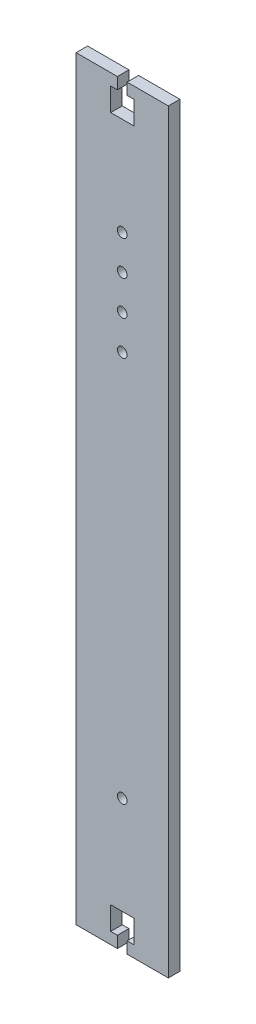
ISO-10303-21;
HEADER;
FILE_DESCRIPTION(('STEP AP214'),'2;1');
FILE_NAME('part.step','',(''),(''),'','','');
FILE_SCHEMA(('AUTOMOTIVE_DESIGN { 1 0 10303 214 1 1 1 1 }'));
ENDSEC;
DATA;
#1=APPLICATION_CONTEXT('core data for automotive mechanical design processes');
#2=APPLICATION_PROTOCOL_DEFINITION('international standard','automotive_design',2000,#1);
#3=PRODUCT_CONTEXT('',#1,'mechanical');
#4=PRODUCT('Part','Part','',(#3));
#5=PRODUCT_RELATED_PRODUCT_CATEGORY('part','',(#4));
#6=PRODUCT_DEFINITION_FORMATION('','',#4);
#7=PRODUCT_DEFINITION_CONTEXT('part definition',#1,'design');
#8=PRODUCT_DEFINITION('design','',#6,#7);
#9=PRODUCT_DEFINITION_SHAPE('','',#8);
#10=(LENGTH_UNIT() NAMED_UNIT(*) SI_UNIT(.MILLI.,.METRE.));
#11=(NAMED_UNIT(*) PLANE_ANGLE_UNIT() SI_UNIT($,.RADIAN.));
#12=(NAMED_UNIT(*) SI_UNIT($,.STERADIAN.) SOLID_ANGLE_UNIT());
#13=UNCERTAINTY_MEASURE_WITH_UNIT(LENGTH_MEASURE(1.E-05),#10,'distance_accuracy_value','');
#14=(GEOMETRIC_REPRESENTATION_CONTEXT(3) GLOBAL_UNCERTAINTY_ASSIGNED_CONTEXT((#13)) GLOBAL_UNIT_ASSIGNED_CONTEXT((#10,
#11,#12)) REPRESENTATION_CONTEXT('',''));
#15=CARTESIAN_POINT('',(0.,0.,0.));
#16=DIRECTION('',(0.,0.,1.));
#17=DIRECTION('',(1.,0.,0.));
#18=AXIS2_PLACEMENT_3D('',#15,#16,#17);
#19=CARTESIAN_POINT('',(0.,0.,5.));
#20=DIRECTION('',(0.,0.,-1.));
#21=DIRECTION('',(-1.,0.,0.));
#22=AXIS2_PLACEMENT_3D('',#19,#20,#21);
#23=PLANE('',#22);
#24=CARTESIAN_POINT('',(-20.,57.5,5.));
#25=DIRECTION('',(0.,0.,-1.));
#26=DIRECTION('',(-1.,0.,0.));
#27=AXIS2_PLACEMENT_3D('',#24,#25,#26);
#28=CIRCLE('',#27,2.1);
#29=CARTESIAN_POINT('',(-22.1,57.5,5.));
#30=VERTEX_POINT('',#29);
#31=EDGE_CURVE('E356',#30,#30,#28,.T.);
#32=ORIENTED_EDGE('',*,*,#31,.T.);
#33=EDGE_LOOP('',(#32));
#34=FACE_BOUND('',#33,.T.);
#35=CARTESIAN_POINT('',(-20.,270.,5.));
#36=DIRECTION('',(0.,0.,-1.));
#37=DIRECTION('',(-1.,0.,0.));
#38=AXIS2_PLACEMENT_3D('',#35,#36,#37);
#39=CIRCLE('',#38,2.09999999999999);
#40=CARTESIAN_POINT('',(-22.1,270.,5.));
#41=VERTEX_POINT('',#40);
#42=EDGE_CURVE('E362',#41,#41,#39,.T.);
#43=ORIENTED_EDGE('',*,*,#42,.T.);
#44=EDGE_LOOP('',(#43));
#45=FACE_BOUND('',#44,.T.);
#46=CARTESIAN_POINT('',(-20.0000000000002,255.,5.));
#47=DIRECTION('',(0.,0.,-1.));
#48=DIRECTION('',(-1.,0.,0.));
#49=AXIS2_PLACEMENT_3D('',#46,#47,#48);
#50=CIRCLE('',#49,2.09999999999999);
#51=CARTESIAN_POINT('',(-22.1000000000002,255.,5.));
#52=VERTEX_POINT('',#51);
#53=EDGE_CURVE('E368',#52,#52,#50,.T.);
#54=ORIENTED_EDGE('',*,*,#53,.T.);
#55=EDGE_LOOP('',(#54));
#56=FACE_BOUND('',#55,.T.);
#57=CARTESIAN_POINT('',(-20.0000000000003,240.,5.));
#58=DIRECTION('',(0.,0.,-1.));
#59=DIRECTION('',(-1.,0.,0.));
#60=AXIS2_PLACEMENT_3D('',#57,#58,#59);
#61=CIRCLE('',#60,2.09999999999999);
#62=CARTESIAN_POINT('',(-22.1000000000003,240.,5.));
#63=VERTEX_POINT('',#62);
#64=EDGE_CURVE('E374',#63,#63,#61,.T.);
#65=ORIENTED_EDGE('',*,*,#64,.T.);
#66=EDGE_LOOP('',(#65));
#67=FACE_BOUND('',#66,.T.);
#68=CARTESIAN_POINT('',(-20.0000000000005,225.,5.));
#69=DIRECTION('',(0.,0.,-1.));
#70=DIRECTION('',(-1.,0.,0.));
#71=AXIS2_PLACEMENT_3D('',#68,#69,#70);
#72=CIRCLE('',#71,2.09999999999999);
#73=CARTESIAN_POINT('',(-22.1000000000005,225.,5.));
#74=VERTEX_POINT('',#73);
#75=EDGE_CURVE('E380',#74,#74,#72,.T.);
#76=ORIENTED_EDGE('',*,*,#75,.T.);
#77=EDGE_LOOP('',(#76));
#78=FACE_BOUND('',#77,.T.);
#79=DIRECTION('',(0.,-1.,0.));
#80=VECTOR('',#79,1.);
#81=CARTESIAN_POINT('',(-22.1,327.5,5.));
#82=LINE('',#81,#80);
#83=CARTESIAN_POINT('',(-22.1,327.5,5.));
#84=VERTEX_POINT('',#83);
#85=CARTESIAN_POINT('',(-22.1,322.5,5.));
#86=VERTEX_POINT('',#85);
#87=EDGE_CURVE('E198',#84,#86,#82,.T.);
#88=ORIENTED_EDGE('',*,*,#87,.F.);
#89=DIRECTION('',(-1.,0.,0.));
#90=VECTOR('',#89,1.);
#91=CARTESIAN_POINT('',(0.,327.5,5.));
#92=LINE('',#91,#90);
#93=CARTESIAN_POINT('',(-40.,327.5,5.));
#94=VERTEX_POINT('',#93);
#95=EDGE_CURVE('E209',#84,#94,#92,.T.);
#96=ORIENTED_EDGE('',*,*,#95,.T.);
#97=DIRECTION('',(0.,-1.,0.));
#98=VECTOR('',#97,1.);
#99=CARTESIAN_POINT('',(-40.,0.,5.));
#100=LINE('',#99,#98);
#101=CARTESIAN_POINT('',(-40.,0.,5.));
#102=VERTEX_POINT('',#101);
#103=EDGE_CURVE('E223',#94,#102,#100,.T.);
#104=ORIENTED_EDGE('',*,*,#103,.T.);
#105=DIRECTION('',(1.,0.,0.));
#106=VECTOR('',#105,1.);
#107=CARTESIAN_POINT('',(0.,0.,5.));
#108=LINE('',#107,#106);
#109=CARTESIAN_POINT('',(-22.1,0.,5.));
#110=VERTEX_POINT('',#109);
#111=EDGE_CURVE('E224',#102,#110,#108,.T.);
#112=ORIENTED_EDGE('',*,*,#111,.T.);
#113=DIRECTION('',(0.,1.,0.));
#114=VECTOR('',#113,1.);
#115=CARTESIAN_POINT('',(-22.1,0.,5.));
#116=LINE('',#115,#114);
#117=CARTESIAN_POINT('',(-22.1,5.,5.));
#118=VERTEX_POINT('',#117);
#119=EDGE_CURVE('E338',#110,#118,#116,.T.);
#120=ORIENTED_EDGE('',*,*,#119,.T.);
#121=DIRECTION('',(-1.,0.,0.));
#122=VECTOR('',#121,1.);
#123=CARTESIAN_POINT('',(0.,5.,5.));
#124=LINE('',#123,#122);
#125=CARTESIAN_POINT('',(-25.,5.,5.));
#126=VERTEX_POINT('',#125);
#127=EDGE_CURVE('E308',#118,#126,#124,.T.);
#128=ORIENTED_EDGE('',*,*,#127,.T.);
#129=DIRECTION('',(0.,1.,0.));
#130=VECTOR('',#129,1.);
#131=CARTESIAN_POINT('',(-25.,0.,5.));
#132=LINE('',#131,#130);
#133=CARTESIAN_POINT('',(-25.,15.,5.));
#134=VERTEX_POINT('',#133);
#135=EDGE_CURVE('E307',#126,#134,#132,.T.);
#136=ORIENTED_EDGE('',*,*,#135,.T.);
#137=DIRECTION('',(-1.,0.,0.));
#138=VECTOR('',#137,1.);
#139=CARTESIAN_POINT('',(0.,15.,5.));
#140=LINE('',#139,#138);
#141=CARTESIAN_POINT('',(-15.,15.,5.));
#142=VERTEX_POINT('',#141);
#143=EDGE_CURVE('E311',#142,#134,#140,.T.);
#144=ORIENTED_EDGE('',*,*,#143,.F.);
#145=DIRECTION('',(0.,1.,0.));
#146=VECTOR('',#145,1.);
#147=CARTESIAN_POINT('',(-15.,0.,5.));
#148=LINE('',#147,#146);
#149=CARTESIAN_POINT('',(-15.,5.,5.));
#150=VERTEX_POINT('',#149);
#151=EDGE_CURVE('E313',#150,#142,#148,.T.);
#152=ORIENTED_EDGE('',*,*,#151,.F.);
#153=CARTESIAN_POINT('',(-17.9,5.,5.));
#154=VERTEX_POINT('',#153);
#155=EDGE_CURVE('E304',#150,#154,#124,.T.);
#156=ORIENTED_EDGE('',*,*,#155,.T.);
#157=DIRECTION('',(0.,1.,0.));
#158=VECTOR('',#157,1.);
#159=CARTESIAN_POINT('',(-17.9,0.,5.));
#160=LINE('',#159,#158);
#161=CARTESIAN_POINT('',(-17.9,0.,5.));
#162=VERTEX_POINT('',#161);
#163=EDGE_CURVE('E341',#162,#154,#160,.T.);
#164=ORIENTED_EDGE('',*,*,#163,.F.);
#165=CARTESIAN_POINT('',(0.,0.,5.));
#166=VERTEX_POINT('',#165);
#167=EDGE_CURVE('E242',#162,#166,#108,.T.);
#168=ORIENTED_EDGE('',*,*,#167,.T.);
#169=DIRECTION('',(0.,1.,0.));
#170=VECTOR('',#169,1.);
#171=CARTESIAN_POINT('',(0.,0.,5.));
#172=LINE('',#171,#170);
#173=CARTESIAN_POINT('',(0.,327.5,5.));
#174=VERTEX_POINT('',#173);
#175=EDGE_CURVE('E220',#166,#174,#172,.T.);
#176=ORIENTED_EDGE('',*,*,#175,.T.);
#177=CARTESIAN_POINT('',(-17.9,327.5,5.));
#178=VERTEX_POINT('',#177);
#179=EDGE_CURVE('E219',#174,#178,#92,.T.);
#180=ORIENTED_EDGE('',*,*,#179,.T.);
#181=DIRECTION('',(0.,-1.,0.));
#182=VECTOR('',#181,1.);
#183=CARTESIAN_POINT('',(-17.9,327.5,5.));
#184=LINE('',#183,#182);
#185=CARTESIAN_POINT('',(-17.9,322.5,5.));
#186=VERTEX_POINT('',#185);
#187=EDGE_CURVE('E73',#178,#186,#184,.T.);
#188=ORIENTED_EDGE('',*,*,#187,.T.);
#189=DIRECTION('',(-1.,0.,0.));
#190=VECTOR('',#189,1.);
#191=CARTESIAN_POINT('',(0.,322.5,5.));
#192=LINE('',#191,#190);
#193=CARTESIAN_POINT('',(-15.,322.5,5.));
#194=VERTEX_POINT('',#193);
#195=EDGE_CURVE('E273',#194,#186,#192,.T.);
#196=ORIENTED_EDGE('',*,*,#195,.F.);
#197=DIRECTION('',(0.,-1.,0.));
#198=VECTOR('',#197,1.);
#199=CARTESIAN_POINT('',(-15.,327.5,5.));
#200=LINE('',#199,#198);
#201=CARTESIAN_POINT('',(-15.,312.5,5.));
#202=VERTEX_POINT('',#201);
#203=EDGE_CURVE('E276',#194,#202,#200,.T.);
#204=ORIENTED_EDGE('',*,*,#203,.T.);
#205=DIRECTION('',(-1.,0.,0.));
#206=VECTOR('',#205,1.);
#207=CARTESIAN_POINT('',(0.,312.5,5.));
#208=LINE('',#207,#206);
#209=CARTESIAN_POINT('',(-25.,312.5,5.));
#210=VERTEX_POINT('',#209);
#211=EDGE_CURVE('E279',#202,#210,#208,.T.);
#212=ORIENTED_EDGE('',*,*,#211,.T.);
#213=DIRECTION('',(0.,-1.,0.));
#214=VECTOR('',#213,1.);
#215=CARTESIAN_POINT('',(-25.,327.5,5.));
#216=LINE('',#215,#214);
#217=CARTESIAN_POINT('',(-25.,322.5,5.));
#218=VERTEX_POINT('',#217);
#219=EDGE_CURVE('E282',#218,#210,#216,.T.);
#220=ORIENTED_EDGE('',*,*,#219,.F.);
#221=EDGE_CURVE('E212',#86,#218,#192,.T.);
#222=ORIENTED_EDGE('',*,*,#221,.F.);
#223=EDGE_LOOP('',(#88,#96,#104,#112,#120,#128,#136,#144,#152,#156,#164,#168,#176,#180,#188,
#196,#204,#212,#220,#222));
#224=FACE_BOUND('',#223,.T.);
#225=ADVANCED_FACE('F58',(#34,#45,#56,#67,#78,#224),#23,.F.);
#226=CARTESIAN_POINT('',(0.,0.,0.));
#227=DIRECTION('',(0.,0.,-1.));
#228=DIRECTION('',(-1.,0.,0.));
#229=AXIS2_PLACEMENT_3D('',#226,#227,#228);
#230=PLANE('',#229);
#231=CARTESIAN_POINT('',(-20.,57.5,0.));
#232=DIRECTION('',(0.,0.,-1.));
#233=DIRECTION('',(-1.,0.,0.));
#234=AXIS2_PLACEMENT_3D('',#231,#232,#233);
#235=CIRCLE('',#234,2.1);
#236=CARTESIAN_POINT('',(-22.1,57.5,0.));
#237=VERTEX_POINT('',#236);
#238=EDGE_CURVE('E359',#237,#237,#235,.T.);
#239=ORIENTED_EDGE('',*,*,#238,.F.);
#240=EDGE_LOOP('',(#239));
#241=FACE_BOUND('',#240,.T.);
#242=CARTESIAN_POINT('',(-20.,270.,0.));
#243=DIRECTION('',(0.,0.,-1.));
#244=DIRECTION('',(-1.,0.,0.));
#245=AXIS2_PLACEMENT_3D('',#242,#243,#244);
#246=CIRCLE('',#245,2.09999999999999);
#247=CARTESIAN_POINT('',(-22.1,270.,0.));
#248=VERTEX_POINT('',#247);
#249=EDGE_CURVE('E365',#248,#248,#246,.T.);
#250=ORIENTED_EDGE('',*,*,#249,.F.);
#251=EDGE_LOOP('',(#250));
#252=FACE_BOUND('',#251,.T.);
#253=CARTESIAN_POINT('',(-20.0000000000002,255.,0.));
#254=DIRECTION('',(0.,0.,-1.));
#255=DIRECTION('',(-1.,0.,0.));
#256=AXIS2_PLACEMENT_3D('',#253,#254,#255);
#257=CIRCLE('',#256,2.09999999999999);
#258=CARTESIAN_POINT('',(-22.1000000000002,255.,0.));
#259=VERTEX_POINT('',#258);
#260=EDGE_CURVE('E371',#259,#259,#257,.T.);
#261=ORIENTED_EDGE('',*,*,#260,.F.);
#262=EDGE_LOOP('',(#261));
#263=FACE_BOUND('',#262,.T.);
#264=CARTESIAN_POINT('',(-20.0000000000003,240.,0.));
#265=DIRECTION('',(0.,0.,-1.));
#266=DIRECTION('',(-1.,0.,0.));
#267=AXIS2_PLACEMENT_3D('',#264,#265,#266);
#268=CIRCLE('',#267,2.09999999999999);
#269=CARTESIAN_POINT('',(-22.1000000000003,240.,0.));
#270=VERTEX_POINT('',#269);
#271=EDGE_CURVE('E377',#270,#270,#268,.T.);
#272=ORIENTED_EDGE('',*,*,#271,.F.);
#273=EDGE_LOOP('',(#272));
#274=FACE_BOUND('',#273,.T.);
#275=CARTESIAN_POINT('',(-20.0000000000005,225.,0.));
#276=DIRECTION('',(0.,0.,-1.));
#277=DIRECTION('',(-1.,0.,0.));
#278=AXIS2_PLACEMENT_3D('',#275,#276,#277);
#279=CIRCLE('',#278,2.09999999999999);
#280=CARTESIAN_POINT('',(-22.1000000000005,225.,0.));
#281=VERTEX_POINT('',#280);
#282=EDGE_CURVE('E355',#281,#281,#279,.T.);
#283=ORIENTED_EDGE('',*,*,#282,.F.);
#284=EDGE_LOOP('',(#283));
#285=FACE_BOUND('',#284,.T.);
#286=DIRECTION('',(-1.,0.,0.));
#287=VECTOR('',#286,1.);
#288=CARTESIAN_POINT('',(0.,327.5,0.));
#289=LINE('',#288,#287);
#290=CARTESIAN_POINT('',(-22.1,327.5,0.));
#291=VERTEX_POINT('',#290);
#292=CARTESIAN_POINT('',(-40.,327.5,0.));
#293=VERTEX_POINT('',#292);
#294=EDGE_CURVE('E236',#291,#293,#289,.T.);
#295=ORIENTED_EDGE('',*,*,#294,.F.);
#296=DIRECTION('',(0.,-1.,0.));
#297=VECTOR('',#296,1.);
#298=CARTESIAN_POINT('',(-22.1,327.5,0.));
#299=LINE('',#298,#297);
#300=CARTESIAN_POINT('',(-22.1,322.5,0.));
#301=VERTEX_POINT('',#300);
#302=EDGE_CURVE('E201',#291,#301,#299,.T.);
#303=ORIENTED_EDGE('',*,*,#302,.T.);
#304=DIRECTION('',(-1.,0.,0.));
#305=VECTOR('',#304,1.);
#306=CARTESIAN_POINT('',(0.,322.5,0.));
#307=LINE('',#306,#305);
#308=CARTESIAN_POINT('',(-25.,322.5,0.));
#309=VERTEX_POINT('',#308);
#310=EDGE_CURVE('E269',#301,#309,#307,.T.);
#311=ORIENTED_EDGE('',*,*,#310,.T.);
#312=DIRECTION('',(0.,-1.,0.));
#313=VECTOR('',#312,1.);
#314=CARTESIAN_POINT('',(-25.,327.5,0.));
#315=LINE('',#314,#313);
#316=CARTESIAN_POINT('',(-25.,312.5,0.));
#317=VERTEX_POINT('',#316);
#318=EDGE_CURVE('E292',#309,#317,#315,.T.);
#319=ORIENTED_EDGE('',*,*,#318,.T.);
#320=DIRECTION('',(-1.,0.,0.));
#321=VECTOR('',#320,1.);
#322=CARTESIAN_POINT('',(0.,312.5,0.));
#323=LINE('',#322,#321);
#324=CARTESIAN_POINT('',(-15.,312.5,0.));
#325=VERTEX_POINT('',#324);
#326=EDGE_CURVE('E289',#325,#317,#323,.T.);
#327=ORIENTED_EDGE('',*,*,#326,.F.);
#328=DIRECTION('',(0.,-1.,0.));
#329=VECTOR('',#328,1.);
#330=CARTESIAN_POINT('',(-15.,327.5,0.));
#331=LINE('',#330,#329);
#332=CARTESIAN_POINT('',(-15.,322.5,0.));
#333=VERTEX_POINT('',#332);
#334=EDGE_CURVE('E286',#333,#325,#331,.T.);
#335=ORIENTED_EDGE('',*,*,#334,.F.);
#336=CARTESIAN_POINT('',(-17.9,322.5,0.));
#337=VERTEX_POINT('',#336);
#338=EDGE_CURVE('E262',#333,#337,#307,.T.);
#339=ORIENTED_EDGE('',*,*,#338,.T.);
#340=DIRECTION('',(0.,-1.,0.));
#341=VECTOR('',#340,1.);
#342=CARTESIAN_POINT('',(-17.9,327.5,0.));
#343=LINE('',#342,#341);
#344=CARTESIAN_POINT('',(-17.9,327.5,0.));
#345=VERTEX_POINT('',#344);
#346=EDGE_CURVE('E213',#345,#337,#343,.T.);
#347=ORIENTED_EDGE('',*,*,#346,.F.);
#348=CARTESIAN_POINT('',(0.,327.5,0.));
#349=VERTEX_POINT('',#348);
#350=EDGE_CURVE('E237',#349,#345,#289,.T.);
#351=ORIENTED_EDGE('',*,*,#350,.F.);
#352=DIRECTION('',(0.,1.,0.));
#353=VECTOR('',#352,1.);
#354=CARTESIAN_POINT('',(0.,0.,0.));
#355=LINE('',#354,#353);
#356=CARTESIAN_POINT('',(0.,0.,0.));
#357=VERTEX_POINT('',#356);
#358=EDGE_CURVE('E233',#357,#349,#355,.T.);
#359=ORIENTED_EDGE('',*,*,#358,.F.);
#360=DIRECTION('',(1.,0.,0.));
#361=VECTOR('',#360,1.);
#362=CARTESIAN_POINT('',(0.,0.,0.));
#363=LINE('',#362,#361);
#364=CARTESIAN_POINT('',(-17.9,0.,0.));
#365=VERTEX_POINT('',#364);
#366=EDGE_CURVE('E234',#365,#357,#363,.T.);
#367=ORIENTED_EDGE('',*,*,#366,.F.);
#368=DIRECTION('',(0.,1.,0.));
#369=VECTOR('',#368,1.);
#370=CARTESIAN_POINT('',(-17.9,0.,0.));
#371=LINE('',#370,#369);
#372=CARTESIAN_POINT('',(-17.9,5.,0.));
#373=VERTEX_POINT('',#372);
#374=EDGE_CURVE('E342',#365,#373,#371,.T.);
#375=ORIENTED_EDGE('',*,*,#374,.T.);
#376=DIRECTION('',(-1.,0.,0.));
#377=VECTOR('',#376,1.);
#378=CARTESIAN_POINT('',(0.,5.,0.));
#379=LINE('',#378,#377);
#380=CARTESIAN_POINT('',(-15.,5.,0.));
#381=VERTEX_POINT('',#380);
#382=EDGE_CURVE('E316',#381,#373,#379,.T.);
#383=ORIENTED_EDGE('',*,*,#382,.F.);
#384=DIRECTION('',(0.,1.,0.));
#385=VECTOR('',#384,1.);
#386=CARTESIAN_POINT('',(-15.,0.,0.));
#387=LINE('',#386,#385);
#388=CARTESIAN_POINT('',(-15.,15.,0.));
#389=VERTEX_POINT('',#388);
#390=EDGE_CURVE('E326',#381,#389,#387,.T.);
#391=ORIENTED_EDGE('',*,*,#390,.T.);
#392=DIRECTION('',(-1.,0.,0.));
#393=VECTOR('',#392,1.);
#394=CARTESIAN_POINT('',(0.,15.,0.));
#395=LINE('',#394,#393);
#396=CARTESIAN_POINT('',(-25.,15.,0.));
#397=VERTEX_POINT('',#396);
#398=EDGE_CURVE('E323',#389,#397,#395,.T.);
#399=ORIENTED_EDGE('',*,*,#398,.T.);
#400=DIRECTION('',(0.,1.,0.));
#401=VECTOR('',#400,1.);
#402=CARTESIAN_POINT('',(-25.,0.,0.));
#403=LINE('',#402,#401);
#404=CARTESIAN_POINT('',(-25.,5.,0.));
#405=VERTEX_POINT('',#404);
#406=EDGE_CURVE('E319',#405,#397,#403,.T.);
#407=ORIENTED_EDGE('',*,*,#406,.F.);
#408=CARTESIAN_POINT('',(-22.1,5.,0.));
#409=VERTEX_POINT('',#408);
#410=EDGE_CURVE('E320',#409,#405,#379,.T.);
#411=ORIENTED_EDGE('',*,*,#410,.F.);
#412=DIRECTION('',(0.,1.,0.));
#413=VECTOR('',#412,1.);
#414=CARTESIAN_POINT('',(-22.1,0.,0.));
#415=LINE('',#414,#413);
#416=CARTESIAN_POINT('',(-22.1,0.,0.));
#417=VERTEX_POINT('',#416);
#418=EDGE_CURVE('E298',#417,#409,#415,.T.);
#419=ORIENTED_EDGE('',*,*,#418,.F.);
#420=CARTESIAN_POINT('',(-40.,0.,0.));
#421=VERTEX_POINT('',#420);
#422=EDGE_CURVE('E230',#421,#417,#363,.T.);
#423=ORIENTED_EDGE('',*,*,#422,.F.);
#424=DIRECTION('',(0.,-1.,0.));
#425=VECTOR('',#424,1.);
#426=CARTESIAN_POINT('',(-40.,0.,0.));
#427=LINE('',#426,#425);
#428=EDGE_CURVE('E240',#293,#421,#427,.T.);
#429=ORIENTED_EDGE('',*,*,#428,.F.);
#430=EDGE_LOOP('',(#295,#303,#311,#319,#327,#335,#339,#347,#351,#359,#367,#375,#383,#391,#399,
#407,#411,#419,#423,#429));
#431=FACE_BOUND('',#430,.T.);
#432=ADVANCED_FACE('F256',(#241,#252,#263,#274,#285,#431),#230,.T.);
#433=CARTESIAN_POINT('',(0.,327.5,5.));
#434=DIRECTION('',(0.,-1.,0.));
#435=DIRECTION('',(0.,0.,-1.));
#436=AXIS2_PLACEMENT_3D('',#433,#434,#435);
#437=PLANE('',#436);
#438=DIRECTION('',(0.,0.,-1.));
#439=VECTOR('',#438,1.);
#440=CARTESIAN_POINT('',(-22.1,327.5,5.));
#441=LINE('',#440,#439);
#442=EDGE_CURVE('E195',#84,#291,#441,.T.);
#443=ORIENTED_EDGE('',*,*,#442,.T.);
#444=ORIENTED_EDGE('',*,*,#294,.T.);
#445=DIRECTION('',(0.,0.,-1.));
#446=VECTOR('',#445,1.);
#447=CARTESIAN_POINT('',(-40.,327.5,5.));
#448=LINE('',#447,#446);
#449=EDGE_CURVE('E217',#94,#293,#448,.T.);
#450=ORIENTED_EDGE('',*,*,#449,.F.);
#451=ORIENTED_EDGE('',*,*,#95,.F.);
#452=EDGE_LOOP('',(#443,#444,#450,#451));
#453=FACE_BOUND('',#452,.T.);
#454=ADVANCED_FACE('F215',(#453),#437,.F.);
#455=CARTESIAN_POINT('',(0.,0.,5.));
#456=DIRECTION('',(0.,1.,0.));
#457=DIRECTION('',(0.,0.,1.));
#458=AXIS2_PLACEMENT_3D('',#455,#456,#457);
#459=PLANE('',#458);
#460=DIRECTION('',(0.,0.,-1.));
#461=VECTOR('',#460,1.);
#462=CARTESIAN_POINT('',(-17.9,0.,5.));
#463=LINE('',#462,#461);
#464=EDGE_CURVE('E345',#162,#365,#463,.T.);
#465=ORIENTED_EDGE('',*,*,#464,.T.);
#466=ORIENTED_EDGE('',*,*,#366,.T.);
#467=DIRECTION('',(0.,0.,-1.));
#468=VECTOR('',#467,1.);
#469=CARTESIAN_POINT('',(0.,0.,5.));
#470=LINE('',#469,#468);
#471=EDGE_CURVE('E12',#166,#357,#470,.T.);
#472=ORIENTED_EDGE('',*,*,#471,.F.);
#473=ORIENTED_EDGE('',*,*,#167,.F.);
#474=EDGE_LOOP('',(#465,#466,#472,#473));
#475=FACE_BOUND('',#474,.T.);
#476=ADVANCED_FACE('F391',(#475),#459,.F.);
#477=ORIENTED_EDGE('',*,*,#422,.T.);
#478=DIRECTION('',(0.,0.,-1.));
#479=VECTOR('',#478,1.);
#480=CARTESIAN_POINT('',(-22.1,0.,5.));
#481=LINE('',#480,#479);
#482=EDGE_CURVE('E81',#110,#417,#481,.T.);
#483=ORIENTED_EDGE('',*,*,#482,.F.);
#484=ORIENTED_EDGE('',*,*,#111,.F.);
#485=DIRECTION('',(0.,0.,-1.));
#486=VECTOR('',#485,1.);
#487=CARTESIAN_POINT('',(-40.,0.,5.));
#488=LINE('',#487,#486);
#489=EDGE_CURVE('E229',#102,#421,#488,.T.);
#490=ORIENTED_EDGE('',*,*,#489,.T.);
#491=EDGE_LOOP('',(#477,#483,#484,#490));
#492=FACE_BOUND('',#491,.T.);
#493=ADVANCED_FACE('F60',(#492),#459,.F.);
#494=CARTESIAN_POINT('',(0.,0.,5.));
#495=DIRECTION('',(-1.,0.,0.));
#496=DIRECTION('',(0.,-1.,0.));
#497=AXIS2_PLACEMENT_3D('',#494,#495,#496);
#498=PLANE('',#497);
#499=ORIENTED_EDGE('',*,*,#358,.T.);
#500=DIRECTION('',(0.,0.,-1.));
#501=VECTOR('',#500,1.);
#502=CARTESIAN_POINT('',(0.,327.5,5.));
#503=LINE('',#502,#501);
#504=EDGE_CURVE('E66',#174,#349,#503,.T.);
#505=ORIENTED_EDGE('',*,*,#504,.F.);
#506=ORIENTED_EDGE('',*,*,#175,.F.);
#507=ORIENTED_EDGE('',*,*,#471,.T.);
#508=EDGE_LOOP('',(#499,#505,#506,#507));
#509=FACE_BOUND('',#508,.T.);
#510=ADVANCED_FACE('F390',(#509),#498,.F.);
#511=ORIENTED_EDGE('',*,*,#350,.T.);
#512=DIRECTION('',(0.,0.,-1.));
#513=VECTOR('',#512,1.);
#514=CARTESIAN_POINT('',(-17.9,327.5,5.));
#515=LINE('',#514,#513);
#516=EDGE_CURVE('E205',#178,#345,#515,.T.);
#517=ORIENTED_EDGE('',*,*,#516,.F.);
#518=ORIENTED_EDGE('',*,*,#179,.F.);
#519=ORIENTED_EDGE('',*,*,#504,.T.);
#520=EDGE_LOOP('',(#511,#517,#518,#519));
#521=FACE_BOUND('',#520,.T.);
#522=ADVANCED_FACE('F250',(#521),#437,.F.);
#523=CARTESIAN_POINT('',(-40.,0.,5.));
#524=DIRECTION('',(1.,0.,0.));
#525=DIRECTION('',(0.,0.,-1.));
#526=AXIS2_PLACEMENT_3D('',#523,#524,#525);
#527=PLANE('',#526);
#528=ORIENTED_EDGE('',*,*,#428,.T.);
#529=ORIENTED_EDGE('',*,*,#489,.F.);
#530=ORIENTED_EDGE('',*,*,#103,.F.);
#531=ORIENTED_EDGE('',*,*,#449,.T.);
#532=EDGE_LOOP('',(#528,#529,#530,#531));
#533=FACE_BOUND('',#532,.T.);
#534=ADVANCED_FACE('F422',(#533),#527,.F.);
#535=CARTESIAN_POINT('',(-20.0000000000005,225.,5.));
#536=DIRECTION('',(0.,0.,-1.));
#537=DIRECTION('',(-1.,0.,0.));
#538=AXIS2_PLACEMENT_3D('',#535,#536,#537);
#539=CYLINDRICAL_SURFACE('',#538,2.09999999999999);
#540=ORIENTED_EDGE('',*,*,#75,.F.);
#541=EDGE_LOOP('',(#540));
#542=FACE_BOUND('',#541,.T.);
#543=ORIENTED_EDGE('',*,*,#282,.T.);
#544=EDGE_LOOP('',(#543));
#545=FACE_BOUND('',#544,.T.);
#546=ADVANCED_FACE('F458',(#542,#545),#539,.F.);
#547=CARTESIAN_POINT('',(-20.0000000000003,240.,5.));
#548=DIRECTION('',(0.,0.,-1.));
#549=DIRECTION('',(-1.,0.,0.));
#550=AXIS2_PLACEMENT_3D('',#547,#548,#549);
#551=CYLINDRICAL_SURFACE('',#550,2.09999999999999);
#552=ORIENTED_EDGE('',*,*,#64,.F.);
#553=EDGE_LOOP('',(#552));
#554=FACE_BOUND('',#553,.T.);
#555=ORIENTED_EDGE('',*,*,#271,.T.);
#556=EDGE_LOOP('',(#555));
#557=FACE_BOUND('',#556,.T.);
#558=ADVANCED_FACE('F584',(#554,#557),#551,.F.);
#559=CARTESIAN_POINT('',(-20.0000000000002,255.,5.));
#560=DIRECTION('',(0.,0.,-1.));
#561=DIRECTION('',(-1.,0.,0.));
#562=AXIS2_PLACEMENT_3D('',#559,#560,#561);
#563=CYLINDRICAL_SURFACE('',#562,2.09999999999999);
#564=ORIENTED_EDGE('',*,*,#53,.F.);
#565=EDGE_LOOP('',(#564));
#566=FACE_BOUND('',#565,.T.);
#567=ORIENTED_EDGE('',*,*,#260,.T.);
#568=EDGE_LOOP('',(#567));
#569=FACE_BOUND('',#568,.T.);
#570=ADVANCED_FACE('F574',(#566,#569),#563,.F.);
#571=CARTESIAN_POINT('',(-20.,270.,5.));
#572=DIRECTION('',(0.,0.,-1.));
#573=DIRECTION('',(-1.,0.,0.));
#574=AXIS2_PLACEMENT_3D('',#571,#572,#573);
#575=CYLINDRICAL_SURFACE('',#574,2.09999999999999);
#576=ORIENTED_EDGE('',*,*,#42,.F.);
#577=EDGE_LOOP('',(#576));
#578=FACE_BOUND('',#577,.T.);
#579=ORIENTED_EDGE('',*,*,#249,.T.);
#580=EDGE_LOOP('',(#579));
#581=FACE_BOUND('',#580,.T.);
#582=ADVANCED_FACE('F564',(#578,#581),#575,.F.);
#583=CARTESIAN_POINT('',(-20.,57.5,5.));
#584=DIRECTION('',(0.,0.,-1.));
#585=DIRECTION('',(-1.,0.,0.));
#586=AXIS2_PLACEMENT_3D('',#583,#584,#585);
#587=CYLINDRICAL_SURFACE('',#586,2.1);
#588=ORIENTED_EDGE('',*,*,#31,.F.);
#589=EDGE_LOOP('',(#588));
#590=FACE_BOUND('',#589,.T.);
#591=ORIENTED_EDGE('',*,*,#238,.T.);
#592=EDGE_LOOP('',(#591));
#593=FACE_BOUND('',#592,.T.);
#594=ADVANCED_FACE('F545',(#590,#593),#587,.F.);
#595=CARTESIAN_POINT('',(0.,15.,5.));
#596=DIRECTION('',(0.,-1.,0.));
#597=DIRECTION('',(0.,0.,-1.));
#598=AXIS2_PLACEMENT_3D('',#595,#596,#597);
#599=PLANE('',#598);
#600=ORIENTED_EDGE('',*,*,#398,.F.);
#601=DIRECTION('',(0.,0.,-1.));
#602=VECTOR('',#601,1.);
#603=CARTESIAN_POINT('',(-15.,15.,5.));
#604=LINE('',#603,#602);
#605=EDGE_CURVE('E332',#142,#389,#604,.T.);
#606=ORIENTED_EDGE('',*,*,#605,.F.);
#607=ORIENTED_EDGE('',*,*,#143,.T.);
#608=DIRECTION('',(0.,0.,-1.));
#609=VECTOR('',#608,1.);
#610=CARTESIAN_POINT('',(-25.,15.,5.));
#611=LINE('',#610,#609);
#612=EDGE_CURVE('E334',#134,#397,#611,.T.);
#613=ORIENTED_EDGE('',*,*,#612,.T.);
#614=EDGE_LOOP('',(#600,#606,#607,#613));
#615=FACE_BOUND('',#614,.T.);
#616=ADVANCED_FACE('F407',(#615),#599,.T.);
#617=CARTESIAN_POINT('',(-25.,0.,5.));
#618=DIRECTION('',(-1.,0.,0.));
#619=DIRECTION('',(0.,-1.,0.));
#620=AXIS2_PLACEMENT_3D('',#617,#618,#619);
#621=PLANE('',#620);
#622=ORIENTED_EDGE('',*,*,#406,.T.);
#623=ORIENTED_EDGE('',*,*,#612,.F.);
#624=ORIENTED_EDGE('',*,*,#135,.F.);
#625=DIRECTION('',(0.,0.,-1.));
#626=VECTOR('',#625,1.);
#627=CARTESIAN_POINT('',(-25.,5.,5.));
#628=LINE('',#627,#626);
#629=EDGE_CURVE('E315',#126,#405,#628,.T.);
#630=ORIENTED_EDGE('',*,*,#629,.T.);
#631=EDGE_LOOP('',(#622,#623,#624,#630));
#632=FACE_BOUND('',#631,.T.);
#633=ADVANCED_FACE('F412',(#632),#621,.F.);
#634=CARTESIAN_POINT('',(-15.,0.,5.));
#635=DIRECTION('',(-1.,0.,0.));
#636=DIRECTION('',(0.,-1.,0.));
#637=AXIS2_PLACEMENT_3D('',#634,#635,#636);
#638=PLANE('',#637);
#639=ORIENTED_EDGE('',*,*,#390,.F.);
#640=DIRECTION('',(0.,0.,-1.));
#641=VECTOR('',#640,1.);
#642=CARTESIAN_POINT('',(-15.,5.,5.));
#643=LINE('',#642,#641);
#644=EDGE_CURVE('E329',#150,#381,#643,.T.);
#645=ORIENTED_EDGE('',*,*,#644,.F.);
#646=ORIENTED_EDGE('',*,*,#151,.T.);
#647=ORIENTED_EDGE('',*,*,#605,.T.);
#648=EDGE_LOOP('',(#639,#645,#646,#647));
#649=FACE_BOUND('',#648,.T.);
#650=ADVANCED_FACE('F401',(#649),#638,.T.);
#651=CARTESIAN_POINT('',(0.,5.,5.));
#652=DIRECTION('',(0.,-1.,0.));
#653=DIRECTION('',(0.,0.,-1.));
#654=AXIS2_PLACEMENT_3D('',#651,#652,#653);
#655=PLANE('',#654);
#656=ORIENTED_EDGE('',*,*,#155,.F.);
#657=ORIENTED_EDGE('',*,*,#644,.T.);
#658=ORIENTED_EDGE('',*,*,#382,.T.);
#659=DIRECTION('',(0.,0.,-1.));
#660=VECTOR('',#659,1.);
#661=CARTESIAN_POINT('',(-17.9,5.,5.));
#662=LINE('',#661,#660);
#663=EDGE_CURVE('E331',#154,#373,#662,.T.);
#664=ORIENTED_EDGE('',*,*,#663,.F.);
#665=EDGE_LOOP('',(#656,#657,#658,#664));
#666=FACE_BOUND('',#665,.T.);
#667=ADVANCED_FACE('F397',(#666),#655,.F.);
#668=DIRECTION('',(0.,0.,-1.));
#669=VECTOR('',#668,1.);
#670=CARTESIAN_POINT('',(-22.1,5.,5.));
#671=LINE('',#670,#669);
#672=EDGE_CURVE('E353',#118,#409,#671,.T.);
#673=ORIENTED_EDGE('',*,*,#672,.T.);
#674=ORIENTED_EDGE('',*,*,#410,.T.);
#675=ORIENTED_EDGE('',*,*,#629,.F.);
#676=ORIENTED_EDGE('',*,*,#127,.F.);
#677=EDGE_LOOP('',(#673,#674,#675,#676));
#678=FACE_BOUND('',#677,.T.);
#679=ADVANCED_FACE('F416',(#678),#655,.F.);
#680=CARTESIAN_POINT('',(-17.9,0.,5.));
#681=DIRECTION('',(-1.,0.,0.));
#682=DIRECTION('',(0.,0.,1.));
#683=AXIS2_PLACEMENT_3D('',#680,#681,#682);
#684=PLANE('',#683);
#685=ORIENTED_EDGE('',*,*,#374,.F.);
#686=ORIENTED_EDGE('',*,*,#464,.F.);
#687=ORIENTED_EDGE('',*,*,#163,.T.);
#688=ORIENTED_EDGE('',*,*,#663,.T.);
#689=EDGE_LOOP('',(#685,#686,#687,#688));
#690=FACE_BOUND('',#689,.T.);
#691=ADVANCED_FACE('F394',(#690),#684,.T.);
#692=CARTESIAN_POINT('',(-22.1,0.,5.));
#693=DIRECTION('',(-1.,0.,0.));
#694=DIRECTION('',(0.,0.,1.));
#695=AXIS2_PLACEMENT_3D('',#692,#693,#694);
#696=PLANE('',#695);
#697=ORIENTED_EDGE('',*,*,#418,.T.);
#698=ORIENTED_EDGE('',*,*,#672,.F.);
#699=ORIENTED_EDGE('',*,*,#119,.F.);
#700=ORIENTED_EDGE('',*,*,#482,.T.);
#701=EDGE_LOOP('',(#697,#698,#699,#700));
#702=FACE_BOUND('',#701,.T.);
#703=ADVANCED_FACE('F491',(#702),#696,.F.);
#704=CARTESIAN_POINT('',(0.,322.5,5.));
#705=DIRECTION('',(0.,-1.,0.));
#706=DIRECTION('',(0.,0.,-1.));
#707=AXIS2_PLACEMENT_3D('',#704,#705,#706);
#708=PLANE('',#707);
#709=DIRECTION('',(0.,0.,-1.));
#710=VECTOR('',#709,1.);
#711=CARTESIAN_POINT('',(-17.9,322.5,5.));
#712=LINE('',#711,#710);
#713=EDGE_CURVE('E270',#186,#337,#712,.T.);
#714=ORIENTED_EDGE('',*,*,#713,.T.);
#715=ORIENTED_EDGE('',*,*,#338,.F.);
#716=DIRECTION('',(0.,0.,-1.));
#717=VECTOR('',#716,1.);
#718=CARTESIAN_POINT('',(-15.,322.5,5.));
#719=LINE('',#718,#717);
#720=EDGE_CURVE('E284',#194,#333,#719,.T.);
#721=ORIENTED_EDGE('',*,*,#720,.F.);
#722=ORIENTED_EDGE('',*,*,#195,.T.);
#723=EDGE_LOOP('',(#714,#715,#721,#722));
#724=FACE_BOUND('',#723,.T.);
#725=ADVANCED_FACE('F440',(#724),#708,.T.);
#726=ORIENTED_EDGE('',*,*,#221,.T.);
#727=DIRECTION('',(0.,0.,-1.));
#728=VECTOR('',#727,1.);
#729=CARTESIAN_POINT('',(-25.,322.5,5.));
#730=LINE('',#729,#728);
#731=EDGE_CURVE('E295',#218,#309,#730,.T.);
#732=ORIENTED_EDGE('',*,*,#731,.T.);
#733=ORIENTED_EDGE('',*,*,#310,.F.);
#734=DIRECTION('',(0.,0.,-1.));
#735=VECTOR('',#734,1.);
#736=CARTESIAN_POINT('',(-22.1,322.5,5.));
#737=LINE('',#736,#735);
#738=EDGE_CURVE('E267',#86,#301,#737,.T.);
#739=ORIENTED_EDGE('',*,*,#738,.F.);
#740=EDGE_LOOP('',(#726,#732,#733,#739));
#741=FACE_BOUND('',#740,.T.);
#742=ADVANCED_FACE('F427',(#741),#708,.T.);
#743=CARTESIAN_POINT('',(-25.,327.5,5.));
#744=DIRECTION('',(1.,0.,0.));
#745=DIRECTION('',(0.,1.,0.));
#746=AXIS2_PLACEMENT_3D('',#743,#744,#745);
#747=PLANE('',#746);
#748=ORIENTED_EDGE('',*,*,#318,.F.);
#749=ORIENTED_EDGE('',*,*,#731,.F.);
#750=ORIENTED_EDGE('',*,*,#219,.T.);
#751=DIRECTION('',(0.,0.,-1.));
#752=VECTOR('',#751,1.);
#753=CARTESIAN_POINT('',(-25.,312.5,5.));
#754=LINE('',#753,#752);
#755=EDGE_CURVE('E299',#210,#317,#754,.T.);
#756=ORIENTED_EDGE('',*,*,#755,.T.);
#757=EDGE_LOOP('',(#748,#749,#750,#756));
#758=FACE_BOUND('',#757,.T.);
#759=ADVANCED_FACE('F430',(#758),#747,.T.);
#760=CARTESIAN_POINT('',(0.,312.5,5.));
#761=DIRECTION('',(0.,-1.,0.));
#762=DIRECTION('',(0.,0.,-1.));
#763=AXIS2_PLACEMENT_3D('',#760,#761,#762);
#764=PLANE('',#763);
#765=ORIENTED_EDGE('',*,*,#326,.T.);
#766=ORIENTED_EDGE('',*,*,#755,.F.);
#767=ORIENTED_EDGE('',*,*,#211,.F.);
#768=DIRECTION('',(0.,0.,-1.));
#769=VECTOR('',#768,1.);
#770=CARTESIAN_POINT('',(-15.,312.5,5.));
#771=LINE('',#770,#769);
#772=EDGE_CURVE('E301',#202,#325,#771,.T.);
#773=ORIENTED_EDGE('',*,*,#772,.T.);
#774=EDGE_LOOP('',(#765,#766,#767,#773));
#775=FACE_BOUND('',#774,.T.);
#776=ADVANCED_FACE('F436',(#775),#764,.F.);
#777=CARTESIAN_POINT('',(-15.,327.5,5.));
#778=DIRECTION('',(1.,0.,0.));
#779=DIRECTION('',(0.,1.,0.));
#780=AXIS2_PLACEMENT_3D('',#777,#778,#779);
#781=PLANE('',#780);
#782=ORIENTED_EDGE('',*,*,#334,.T.);
#783=ORIENTED_EDGE('',*,*,#772,.F.);
#784=ORIENTED_EDGE('',*,*,#203,.F.);
#785=ORIENTED_EDGE('',*,*,#720,.T.);
#786=EDGE_LOOP('',(#782,#783,#784,#785));
#787=FACE_BOUND('',#786,.T.);
#788=ADVANCED_FACE('F438',(#787),#781,.F.);
#789=CARTESIAN_POINT('',(-22.1,327.5,5.));
#790=DIRECTION('',(1.,0.,0.));
#791=DIRECTION('',(0.,0.,-1.));
#792=AXIS2_PLACEMENT_3D('',#789,#790,#791);
#793=PLANE('',#792);
#794=ORIENTED_EDGE('',*,*,#302,.F.);
#795=ORIENTED_EDGE('',*,*,#442,.F.);
#796=ORIENTED_EDGE('',*,*,#87,.T.);
#797=ORIENTED_EDGE('',*,*,#738,.T.);
#798=EDGE_LOOP('',(#794,#795,#796,#797));
#799=FACE_BOUND('',#798,.T.);
#800=ADVANCED_FACE('F197',(#799),#793,.T.);
#801=CARTESIAN_POINT('',(-17.9,327.5,5.));
#802=DIRECTION('',(1.,0.,0.));
#803=DIRECTION('',(0.,0.,-1.));
#804=AXIS2_PLACEMENT_3D('',#801,#802,#803);
#805=PLANE('',#804);
#806=ORIENTED_EDGE('',*,*,#346,.T.);
#807=ORIENTED_EDGE('',*,*,#713,.F.);
#808=ORIENTED_EDGE('',*,*,#187,.F.);
#809=ORIENTED_EDGE('',*,*,#516,.T.);
#810=EDGE_LOOP('',(#806,#807,#808,#809));
#811=FACE_BOUND('',#810,.T.);
#812=ADVANCED_FACE('F441',(#811),#805,.F.);
#813=CLOSED_SHELL('',(#225,#432,#454,#476,#493,#510,#522,#534,#546,#558,#570,#582,#594,#616,
#633,#650,#667,#679,#691,#703,#725,#742,#759,#776,#788,#800,#812));
#814=MANIFOLD_SOLID_BREP('B2',#813);
#815=ADVANCED_BREP_SHAPE_REPRESENTATION('',(#18,#814),#14);
#816=SHAPE_DEFINITION_REPRESENTATION(#9,#815);
ENDSEC;
END-ISO-10303-21;
